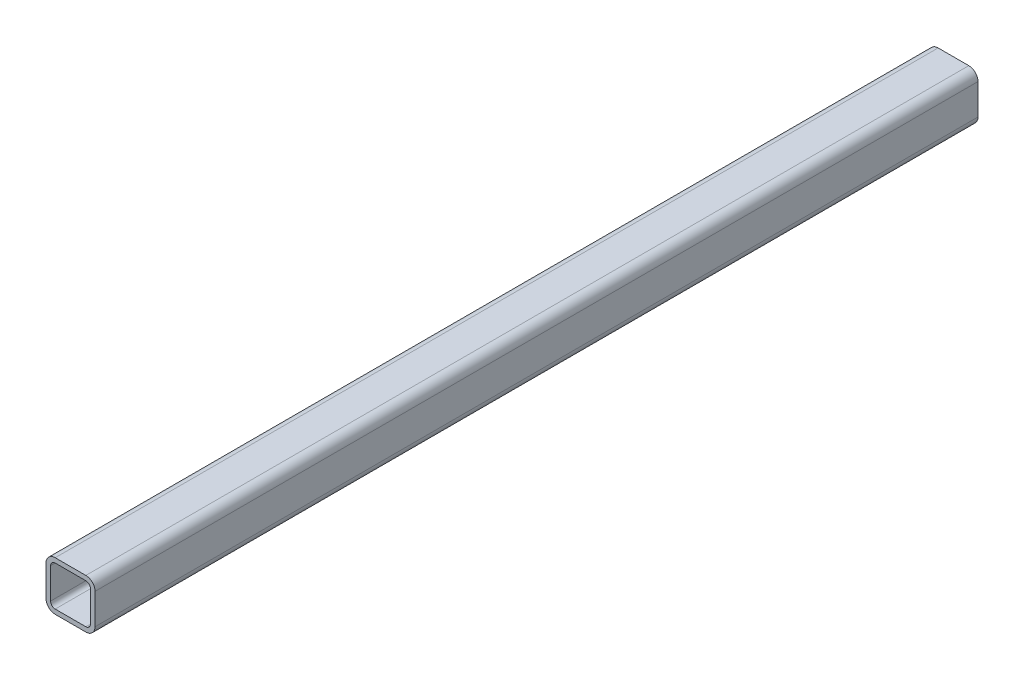
ISO-10303-21;
HEADER;
FILE_DESCRIPTION(('STEP AP214'),'2;1');
FILE_NAME('part.step','',(''),(''),'','','');
FILE_SCHEMA(('AUTOMOTIVE_DESIGN { 1 0 10303 214 1 1 1 1 }'));
ENDSEC;
DATA;
#1=APPLICATION_CONTEXT('core data for automotive mechanical design processes');
#2=APPLICATION_PROTOCOL_DEFINITION('international standard','automotive_design',2000,#1);
#3=PRODUCT_CONTEXT('',#1,'mechanical');
#4=PRODUCT('Part','Part','',(#3));
#5=PRODUCT_RELATED_PRODUCT_CATEGORY('part','',(#4));
#6=PRODUCT_DEFINITION_FORMATION('','',#4);
#7=PRODUCT_DEFINITION_CONTEXT('part definition',#1,'design');
#8=PRODUCT_DEFINITION('design','',#6,#7);
#9=PRODUCT_DEFINITION_SHAPE('','',#8);
#10=(LENGTH_UNIT() NAMED_UNIT(*) SI_UNIT(.MILLI.,.METRE.));
#11=(NAMED_UNIT(*) PLANE_ANGLE_UNIT() SI_UNIT($,.RADIAN.));
#12=(NAMED_UNIT(*) SI_UNIT($,.STERADIAN.) SOLID_ANGLE_UNIT());
#13=UNCERTAINTY_MEASURE_WITH_UNIT(LENGTH_MEASURE(1.E-05),#10,'distance_accuracy_value','');
#14=(GEOMETRIC_REPRESENTATION_CONTEXT(3) GLOBAL_UNCERTAINTY_ASSIGNED_CONTEXT((#13)) GLOBAL_UNIT_ASSIGNED_CONTEXT((#10,
#11,#12)) REPRESENTATION_CONTEXT('',''));
#15=CARTESIAN_POINT('',(0.,0.,0.));
#16=DIRECTION('',(0.,0.,1.));
#17=DIRECTION('',(1.,0.,0.));
#18=AXIS2_PLACEMENT_3D('',#15,#16,#17);
#19=CARTESIAN_POINT('',(41.27496425,41.27496425,457.2));
#20=DIRECTION('',(0.,0.,1.));
#21=DIRECTION('',(1.,0.,0.));
#22=AXIS2_PLACEMENT_3D('',#19,#20,#21);
#23=PLANE('',#22);
#24=CARTESIAN_POINT('',(41.27496425,41.27496425,457.2));
#25=DIRECTION('',(0.,0.,1.));
#26=DIRECTION('',(1.,0.,0.));
#27=AXIS2_PLACEMENT_3D('',#24,#25,#26);
#28=CIRCLE('',#27,9.52499175);
#29=CARTESIAN_POINT('',(50.799956,41.27496425,457.2));
#30=VERTEX_POINT('',#29);
#31=CARTESIAN_POINT('',(41.27496425,50.799956,457.2));
#32=VERTEX_POINT('',#31);
#33=EDGE_CURVE('E213',#30,#32,#28,.T.);
#34=ORIENTED_EDGE('',*,*,#33,.T.);
#35=DIRECTION('',(-1.,0.,0.));
#36=VECTOR('',#35,1.);
#37=CARTESIAN_POINT('',(41.27496425,50.799956,457.2));
#38=LINE('',#37,#36);
#39=CARTESIAN_POINT('',(9.52499174999999,50.799956,457.2));
#40=VERTEX_POINT('',#39);
#41=EDGE_CURVE('E216',#32,#40,#38,.T.);
#42=ORIENTED_EDGE('',*,*,#41,.T.);
#43=CARTESIAN_POINT('',(9.52499174999999,41.27496425,457.2));
#44=DIRECTION('',(0.,0.,1.));
#45=DIRECTION('',(1.,0.,0.));
#46=AXIS2_PLACEMENT_3D('',#43,#44,#45);
#47=CIRCLE('',#46,9.52499175);
#48=CARTESIAN_POINT('',(0.,41.27496425,457.2));
#49=VERTEX_POINT('',#48);
#50=EDGE_CURVE('E219',#40,#49,#47,.T.);
#51=ORIENTED_EDGE('',*,*,#50,.T.);
#52=DIRECTION('',(0.,-1.,0.));
#53=VECTOR('',#52,1.);
#54=CARTESIAN_POINT('',(0.,9.52499175,457.2));
#55=LINE('',#54,#53);
#56=CARTESIAN_POINT('',(0.,9.52499175,457.2));
#57=VERTEX_POINT('',#56);
#58=EDGE_CURVE('E221',#49,#57,#55,.T.);
#59=ORIENTED_EDGE('',*,*,#58,.T.);
#60=CARTESIAN_POINT('',(9.52499175,9.52499175,457.2));
#61=DIRECTION('',(0.,0.,1.));
#62=DIRECTION('',(1.,0.,0.));
#63=AXIS2_PLACEMENT_3D('',#60,#61,#62);
#64=CIRCLE('',#63,9.52499175);
#65=CARTESIAN_POINT('',(9.52499175,0.,457.2));
#66=VERTEX_POINT('',#65);
#67=EDGE_CURVE('E223',#57,#66,#64,.T.);
#68=ORIENTED_EDGE('',*,*,#67,.T.);
#69=DIRECTION('',(1.,0.,0.));
#70=VECTOR('',#69,1.);
#71=CARTESIAN_POINT('',(9.52499175,0.,457.2));
#72=LINE('',#71,#70);
#73=CARTESIAN_POINT('',(41.27496425,0.,457.2));
#74=VERTEX_POINT('',#73);
#75=EDGE_CURVE('E225',#66,#74,#72,.T.);
#76=ORIENTED_EDGE('',*,*,#75,.T.);
#77=CARTESIAN_POINT('',(41.27496425,9.52499175,457.2));
#78=DIRECTION('',(0.,0.,1.));
#79=DIRECTION('',(1.,0.,0.));
#80=AXIS2_PLACEMENT_3D('',#77,#78,#79);
#81=CIRCLE('',#80,9.52499175);
#82=CARTESIAN_POINT('',(50.799956,9.52499175,457.2));
#83=VERTEX_POINT('',#82);
#84=EDGE_CURVE('E227',#74,#83,#81,.T.);
#85=ORIENTED_EDGE('',*,*,#84,.T.);
#86=DIRECTION('',(0.,1.,0.));
#87=VECTOR('',#86,1.);
#88=CARTESIAN_POINT('',(50.799956,41.27496425,457.2));
#89=LINE('',#88,#87);
#90=EDGE_CURVE('E229',#83,#30,#89,.T.);
#91=ORIENTED_EDGE('',*,*,#90,.T.);
#92=EDGE_LOOP('',(#34,#42,#51,#59,#68,#76,#85,#91));
#93=FACE_BOUND('',#92,.T.);
#94=DIRECTION('',(0.,-1.,0.));
#95=VECTOR('',#94,1.);
#96=CARTESIAN_POINT('',(4.762495875,9.52499175,457.2));
#97=LINE('',#96,#95);
#98=CARTESIAN_POINT('',(4.76249587499999,41.27496425,457.2));
#99=VERTEX_POINT('',#98);
#100=CARTESIAN_POINT('',(4.762495875,9.52499175,457.2));
#101=VERTEX_POINT('',#100);
#102=EDGE_CURVE('E156',#99,#101,#97,.T.);
#103=ORIENTED_EDGE('',*,*,#102,.F.);
#104=CARTESIAN_POINT('',(9.52499174999999,41.27496425,457.2));
#105=DIRECTION('',(0.,0.,1.));
#106=DIRECTION('',(1.,0.,0.));
#107=AXIS2_PLACEMENT_3D('',#104,#105,#106);
#108=CIRCLE('',#107,4.762495875);
#109=CARTESIAN_POINT('',(9.52499174999999,46.037460125,457.2));
#110=VERTEX_POINT('',#109);
#111=EDGE_CURVE('E148',#110,#99,#108,.T.);
#112=ORIENTED_EDGE('',*,*,#111,.F.);
#113=DIRECTION('',(-1.,0.,0.));
#114=VECTOR('',#113,1.);
#115=CARTESIAN_POINT('',(41.27496425,46.037460125,457.2));
#116=LINE('',#115,#114);
#117=CARTESIAN_POINT('',(41.27496425,46.037460125,457.2));
#118=VERTEX_POINT('',#117);
#119=EDGE_CURVE('E181',#118,#110,#116,.T.);
#120=ORIENTED_EDGE('',*,*,#119,.F.);
#121=CARTESIAN_POINT('',(41.27496425,41.27496425,457.2));
#122=DIRECTION('',(0.,0.,1.));
#123=DIRECTION('',(1.,0.,0.));
#124=AXIS2_PLACEMENT_3D('',#121,#122,#123);
#125=CIRCLE('',#124,4.76249587500001);
#126=CARTESIAN_POINT('',(46.037460125,41.27496425,457.2));
#127=VERTEX_POINT('',#126);
#128=EDGE_CURVE('E179',#127,#118,#125,.T.);
#129=ORIENTED_EDGE('',*,*,#128,.F.);
#130=DIRECTION('',(0.,1.,0.));
#131=VECTOR('',#130,1.);
#132=CARTESIAN_POINT('',(46.037460125,41.27496425,457.2));
#133=LINE('',#132,#131);
#134=CARTESIAN_POINT('',(46.037460125,9.52499175,457.2));
#135=VERTEX_POINT('',#134);
#136=EDGE_CURVE('E177',#135,#127,#133,.T.);
#137=ORIENTED_EDGE('',*,*,#136,.F.);
#138=CARTESIAN_POINT('',(41.27496425,9.52499175,457.2));
#139=DIRECTION('',(0.,0.,1.));
#140=DIRECTION('',(1.,0.,0.));
#141=AXIS2_PLACEMENT_3D('',#138,#139,#140);
#142=CIRCLE('',#141,4.762495875);
#143=CARTESIAN_POINT('',(41.27496425,4.762495875,457.2));
#144=VERTEX_POINT('',#143);
#145=EDGE_CURVE('E175',#144,#135,#142,.T.);
#146=ORIENTED_EDGE('',*,*,#145,.F.);
#147=DIRECTION('',(1.,0.,0.));
#148=VECTOR('',#147,1.);
#149=CARTESIAN_POINT('',(9.52499175,4.762495875,457.2));
#150=LINE('',#149,#148);
#151=CARTESIAN_POINT('',(9.52499175,4.762495875,457.2));
#152=VERTEX_POINT('',#151);
#153=EDGE_CURVE('E171',#152,#144,#150,.T.);
#154=ORIENTED_EDGE('',*,*,#153,.F.);
#155=CARTESIAN_POINT('',(9.52499175,9.52499175,457.2));
#156=DIRECTION('',(0.,0.,1.));
#157=DIRECTION('',(1.,0.,0.));
#158=AXIS2_PLACEMENT_3D('',#155,#156,#157);
#159=CIRCLE('',#158,4.762495875);
#160=EDGE_CURVE('E169',#101,#152,#159,.T.);
#161=ORIENTED_EDGE('',*,*,#160,.F.);
#162=EDGE_LOOP('',(#103,#112,#120,#129,#137,#146,#154,#161));
#163=FACE_BOUND('',#162,.T.);
#164=ADVANCED_FACE('F35',(#93,#163),#23,.T.);
#165=CARTESIAN_POINT('',(41.27496425,41.27496425,-457.2));
#166=DIRECTION('',(0.,0.,1.));
#167=DIRECTION('',(1.,0.,0.));
#168=AXIS2_PLACEMENT_3D('',#165,#166,#167);
#169=PLANE('',#168);
#170=CARTESIAN_POINT('',(41.27496425,41.27496425,-457.2));
#171=DIRECTION('',(0.,0.,1.));
#172=DIRECTION('',(1.,0.,0.));
#173=AXIS2_PLACEMENT_3D('',#170,#171,#172);
#174=CIRCLE('',#173,9.52499175);
#175=CARTESIAN_POINT('',(50.799956,41.27496425,-457.2));
#176=VERTEX_POINT('',#175);
#177=CARTESIAN_POINT('',(41.27496425,50.799956,-457.2));
#178=VERTEX_POINT('',#177);
#179=EDGE_CURVE('E164',#176,#178,#174,.T.);
#180=ORIENTED_EDGE('',*,*,#179,.F.);
#181=DIRECTION('',(0.,1.,0.));
#182=VECTOR('',#181,1.);
#183=CARTESIAN_POINT('',(50.799956,41.27496425,-457.2));
#184=LINE('',#183,#182);
#185=CARTESIAN_POINT('',(50.799956,9.52499175,-457.2));
#186=VERTEX_POINT('',#185);
#187=EDGE_CURVE('E217',#186,#176,#184,.T.);
#188=ORIENTED_EDGE('',*,*,#187,.F.);
#189=CARTESIAN_POINT('',(41.27496425,9.52499175,-457.2));
#190=DIRECTION('',(0.,0.,1.));
#191=DIRECTION('',(1.,0.,0.));
#192=AXIS2_PLACEMENT_3D('',#189,#190,#191);
#193=CIRCLE('',#192,9.52499175);
#194=CARTESIAN_POINT('',(41.27496425,0.,-457.2));
#195=VERTEX_POINT('',#194);
#196=EDGE_CURVE('E244',#195,#186,#193,.T.);
#197=ORIENTED_EDGE('',*,*,#196,.F.);
#198=DIRECTION('',(1.,0.,0.));
#199=VECTOR('',#198,1.);
#200=CARTESIAN_POINT('',(9.52499175,0.,-457.2));
#201=LINE('',#200,#199);
#202=CARTESIAN_POINT('',(9.52499175,0.,-457.2));
#203=VERTEX_POINT('',#202);
#204=EDGE_CURVE('E242',#203,#195,#201,.T.);
#205=ORIENTED_EDGE('',*,*,#204,.F.);
#206=CARTESIAN_POINT('',(9.52499175,9.52499175,-457.2));
#207=DIRECTION('',(0.,0.,1.));
#208=DIRECTION('',(1.,0.,0.));
#209=AXIS2_PLACEMENT_3D('',#206,#207,#208);
#210=CIRCLE('',#209,9.52499175);
#211=CARTESIAN_POINT('',(0.,9.52499175,-457.2));
#212=VERTEX_POINT('',#211);
#213=EDGE_CURVE('E240',#212,#203,#210,.T.);
#214=ORIENTED_EDGE('',*,*,#213,.F.);
#215=DIRECTION('',(0.,-1.,0.));
#216=VECTOR('',#215,1.);
#217=CARTESIAN_POINT('',(0.,9.52499175,-457.2));
#218=LINE('',#217,#216);
#219=CARTESIAN_POINT('',(0.,41.27496425,-457.2));
#220=VERTEX_POINT('',#219);
#221=EDGE_CURVE('E238',#220,#212,#218,.T.);
#222=ORIENTED_EDGE('',*,*,#221,.F.);
#223=CARTESIAN_POINT('',(9.52499174999999,41.27496425,-457.2));
#224=DIRECTION('',(0.,0.,1.));
#225=DIRECTION('',(1.,0.,0.));
#226=AXIS2_PLACEMENT_3D('',#223,#224,#225);
#227=CIRCLE('',#226,9.52499175);
#228=CARTESIAN_POINT('',(9.52499174999999,50.799956,-457.2));
#229=VERTEX_POINT('',#228);
#230=EDGE_CURVE('E236',#229,#220,#227,.T.);
#231=ORIENTED_EDGE('',*,*,#230,.F.);
#232=DIRECTION('',(-1.,0.,0.));
#233=VECTOR('',#232,1.);
#234=CARTESIAN_POINT('',(41.27496425,50.799956,-457.2));
#235=LINE('',#234,#233);
#236=EDGE_CURVE('E234',#178,#229,#235,.T.);
#237=ORIENTED_EDGE('',*,*,#236,.F.);
#238=EDGE_LOOP('',(#180,#188,#197,#205,#214,#222,#231,#237));
#239=FACE_BOUND('',#238,.T.);
#240=CARTESIAN_POINT('',(9.52499174999999,41.27496425,-457.2));
#241=DIRECTION('',(0.,0.,1.));
#242=DIRECTION('',(1.,0.,0.));
#243=AXIS2_PLACEMENT_3D('',#240,#241,#242);
#244=CIRCLE('',#243,4.762495875);
#245=CARTESIAN_POINT('',(9.52499175,46.037460125,-457.2));
#246=VERTEX_POINT('',#245);
#247=CARTESIAN_POINT('',(4.76249587499999,41.27496425,-457.2));
#248=VERTEX_POINT('',#247);
#249=EDGE_CURVE('E58',#246,#248,#244,.T.);
#250=ORIENTED_EDGE('',*,*,#249,.T.);
#251=DIRECTION('',(0.,-1.,0.));
#252=VECTOR('',#251,1.);
#253=CARTESIAN_POINT('',(4.762495875,9.52499175,-457.2));
#254=LINE('',#253,#252);
#255=CARTESIAN_POINT('',(4.762495875,9.52499175,-457.2));
#256=VERTEX_POINT('',#255);
#257=EDGE_CURVE('E163',#248,#256,#254,.T.);
#258=ORIENTED_EDGE('',*,*,#257,.T.);
#259=CARTESIAN_POINT('',(9.52499175,9.52499175,-457.2));
#260=DIRECTION('',(0.,0.,1.));
#261=DIRECTION('',(1.,0.,0.));
#262=AXIS2_PLACEMENT_3D('',#259,#260,#261);
#263=CIRCLE('',#262,4.762495875);
#264=CARTESIAN_POINT('',(9.52499175,4.762495875,-457.2));
#265=VERTEX_POINT('',#264);
#266=EDGE_CURVE('E185',#256,#265,#263,.T.);
#267=ORIENTED_EDGE('',*,*,#266,.T.);
#268=DIRECTION('',(1.,0.,0.));
#269=VECTOR('',#268,1.);
#270=CARTESIAN_POINT('',(9.52499175,4.762495875,-457.2));
#271=LINE('',#270,#269);
#272=CARTESIAN_POINT('',(41.27496425,4.762495875,-457.2));
#273=VERTEX_POINT('',#272);
#274=EDGE_CURVE('E188',#265,#273,#271,.T.);
#275=ORIENTED_EDGE('',*,*,#274,.T.);
#276=CARTESIAN_POINT('',(41.27496425,9.52499175,-457.2));
#277=DIRECTION('',(0.,0.,1.));
#278=DIRECTION('',(1.,0.,0.));
#279=AXIS2_PLACEMENT_3D('',#276,#277,#278);
#280=CIRCLE('',#279,4.762495875);
#281=CARTESIAN_POINT('',(46.037460125,9.52499175,-457.2));
#282=VERTEX_POINT('',#281);
#283=EDGE_CURVE('E191',#273,#282,#280,.T.);
#284=ORIENTED_EDGE('',*,*,#283,.T.);
#285=DIRECTION('',(0.,1.,0.));
#286=VECTOR('',#285,1.);
#287=CARTESIAN_POINT('',(46.037460125,41.27496425,-457.2));
#288=LINE('',#287,#286);
#289=CARTESIAN_POINT('',(46.037460125,41.27496425,-457.2));
#290=VERTEX_POINT('',#289);
#291=EDGE_CURVE('E194',#282,#290,#288,.T.);
#292=ORIENTED_EDGE('',*,*,#291,.T.);
#293=CARTESIAN_POINT('',(41.27496425,41.27496425,-457.2));
#294=DIRECTION('',(0.,0.,1.));
#295=DIRECTION('',(1.,0.,0.));
#296=AXIS2_PLACEMENT_3D('',#293,#294,#295);
#297=CIRCLE('',#296,4.76249587500001);
#298=CARTESIAN_POINT('',(41.27496425,46.037460125,-457.2));
#299=VERTEX_POINT('',#298);
#300=EDGE_CURVE('E197',#290,#299,#297,.T.);
#301=ORIENTED_EDGE('',*,*,#300,.T.);
#302=DIRECTION('',(-1.,0.,0.));
#303=VECTOR('',#302,1.);
#304=CARTESIAN_POINT('',(41.27496425,46.037460125,-457.2));
#305=LINE('',#304,#303);
#306=EDGE_CURVE('E157',#299,#246,#305,.T.);
#307=ORIENTED_EDGE('',*,*,#306,.T.);
#308=EDGE_LOOP('',(#250,#258,#267,#275,#284,#292,#301,#307));
#309=FACE_BOUND('',#308,.T.);
#310=ADVANCED_FACE('F274',(#239,#309),#169,.F.);
#311=CARTESIAN_POINT('',(41.27496425,41.27496425,457.2));
#312=DIRECTION('',(0.,0.,-1.));
#313=DIRECTION('',(-1.,0.,0.));
#314=AXIS2_PLACEMENT_3D('',#311,#312,#313);
#315=CYLINDRICAL_SURFACE('',#314,9.52499175);
#316=ORIENTED_EDGE('',*,*,#179,.T.);
#317=DIRECTION('',(0.,0.,-1.));
#318=VECTOR('',#317,1.);
#319=CARTESIAN_POINT('',(41.27496425,50.799956,457.2));
#320=LINE('',#319,#318);
#321=EDGE_CURVE('E11',#32,#178,#320,.T.);
#322=ORIENTED_EDGE('',*,*,#321,.F.);
#323=ORIENTED_EDGE('',*,*,#33,.F.);
#324=DIRECTION('',(0.,0.,-1.));
#325=VECTOR('',#324,1.);
#326=CARTESIAN_POINT('',(50.799956,41.27496425,457.2));
#327=LINE('',#326,#325);
#328=EDGE_CURVE('E231',#30,#176,#327,.T.);
#329=ORIENTED_EDGE('',*,*,#328,.T.);
#330=EDGE_LOOP('',(#316,#322,#323,#329));
#331=FACE_BOUND('',#330,.T.);
#332=ADVANCED_FACE('F37',(#331),#315,.T.);
#333=CARTESIAN_POINT('',(41.27496425,50.799956,457.2));
#334=DIRECTION('',(0.,-1.,0.));
#335=DIRECTION('',(0.,0.,-1.));
#336=AXIS2_PLACEMENT_3D('',#333,#334,#335);
#337=PLANE('',#336);
#338=ORIENTED_EDGE('',*,*,#236,.T.);
#339=DIRECTION('',(0.,0.,-1.));
#340=VECTOR('',#339,1.);
#341=CARTESIAN_POINT('',(9.52499174999999,50.799956,457.2));
#342=LINE('',#341,#340);
#343=EDGE_CURVE('E43',#40,#229,#342,.T.);
#344=ORIENTED_EDGE('',*,*,#343,.F.);
#345=ORIENTED_EDGE('',*,*,#41,.F.);
#346=ORIENTED_EDGE('',*,*,#321,.T.);
#347=EDGE_LOOP('',(#338,#344,#345,#346));
#348=FACE_BOUND('',#347,.T.);
#349=ADVANCED_FACE('F291',(#348),#337,.F.);
#350=CARTESIAN_POINT('',(9.52499174999999,41.27496425,457.2));
#351=DIRECTION('',(0.,0.,-1.));
#352=DIRECTION('',(-1.,0.,0.));
#353=AXIS2_PLACEMENT_3D('',#350,#351,#352);
#354=CYLINDRICAL_SURFACE('',#353,9.52499175);
#355=ORIENTED_EDGE('',*,*,#230,.T.);
#356=DIRECTION('',(0.,0.,-1.));
#357=VECTOR('',#356,1.);
#358=CARTESIAN_POINT('',(0.,41.27496425,457.2));
#359=LINE('',#358,#357);
#360=EDGE_CURVE('E261',#49,#220,#359,.T.);
#361=ORIENTED_EDGE('',*,*,#360,.F.);
#362=ORIENTED_EDGE('',*,*,#50,.F.);
#363=ORIENTED_EDGE('',*,*,#343,.T.);
#364=EDGE_LOOP('',(#355,#361,#362,#363));
#365=FACE_BOUND('',#364,.T.);
#366=ADVANCED_FACE('F268',(#365),#354,.T.);
#367=CARTESIAN_POINT('',(0.,9.52499175,457.2));
#368=DIRECTION('',(1.,0.,0.));
#369=DIRECTION('',(0.,1.,0.));
#370=AXIS2_PLACEMENT_3D('',#367,#368,#369);
#371=PLANE('',#370);
#372=ORIENTED_EDGE('',*,*,#221,.T.);
#373=DIRECTION('',(0.,0.,-1.));
#374=VECTOR('',#373,1.);
#375=CARTESIAN_POINT('',(0.,9.52499175,457.2));
#376=LINE('',#375,#374);
#377=EDGE_CURVE('E258',#57,#212,#376,.T.);
#378=ORIENTED_EDGE('',*,*,#377,.F.);
#379=ORIENTED_EDGE('',*,*,#58,.F.);
#380=ORIENTED_EDGE('',*,*,#360,.T.);
#381=EDGE_LOOP('',(#372,#378,#379,#380));
#382=FACE_BOUND('',#381,.T.);
#383=ADVANCED_FACE('F280',(#382),#371,.F.);
#384=CARTESIAN_POINT('',(9.52499175,9.52499175,457.2));
#385=DIRECTION('',(0.,0.,-1.));
#386=DIRECTION('',(-1.,0.,0.));
#387=AXIS2_PLACEMENT_3D('',#384,#385,#386);
#388=CYLINDRICAL_SURFACE('',#387,9.52499175);
#389=ORIENTED_EDGE('',*,*,#213,.T.);
#390=DIRECTION('',(0.,0.,-1.));
#391=VECTOR('',#390,1.);
#392=CARTESIAN_POINT('',(9.52499175,0.,457.2));
#393=LINE('',#392,#391);
#394=EDGE_CURVE('E255',#66,#203,#393,.T.);
#395=ORIENTED_EDGE('',*,*,#394,.F.);
#396=ORIENTED_EDGE('',*,*,#67,.F.);
#397=ORIENTED_EDGE('',*,*,#377,.T.);
#398=EDGE_LOOP('',(#389,#395,#396,#397));
#399=FACE_BOUND('',#398,.T.);
#400=ADVANCED_FACE('F284',(#399),#388,.T.);
#401=CARTESIAN_POINT('',(9.52499175,0.,457.2));
#402=DIRECTION('',(0.,1.,0.));
#403=DIRECTION('',(0.,0.,1.));
#404=AXIS2_PLACEMENT_3D('',#401,#402,#403);
#405=PLANE('',#404);
#406=ORIENTED_EDGE('',*,*,#204,.T.);
#407=DIRECTION('',(0.,0.,-1.));
#408=VECTOR('',#407,1.);
#409=CARTESIAN_POINT('',(41.27496425,0.,457.2));
#410=LINE('',#409,#408);
#411=EDGE_CURVE('E252',#74,#195,#410,.T.);
#412=ORIENTED_EDGE('',*,*,#411,.F.);
#413=ORIENTED_EDGE('',*,*,#75,.F.);
#414=ORIENTED_EDGE('',*,*,#394,.T.);
#415=EDGE_LOOP('',(#406,#412,#413,#414));
#416=FACE_BOUND('',#415,.T.);
#417=ADVANCED_FACE('F304',(#416),#405,.F.);
#418=CARTESIAN_POINT('',(41.27496425,9.52499175,457.2));
#419=DIRECTION('',(0.,0.,-1.));
#420=DIRECTION('',(-1.,0.,0.));
#421=AXIS2_PLACEMENT_3D('',#418,#419,#420);
#422=CYLINDRICAL_SURFACE('',#421,9.52499175);
#423=ORIENTED_EDGE('',*,*,#196,.T.);
#424=DIRECTION('',(0.,0.,-1.));
#425=VECTOR('',#424,1.);
#426=CARTESIAN_POINT('',(50.799956,9.52499175,457.2));
#427=LINE('',#426,#425);
#428=EDGE_CURVE('E249',#83,#186,#427,.T.);
#429=ORIENTED_EDGE('',*,*,#428,.F.);
#430=ORIENTED_EDGE('',*,*,#84,.F.);
#431=ORIENTED_EDGE('',*,*,#411,.T.);
#432=EDGE_LOOP('',(#423,#429,#430,#431));
#433=FACE_BOUND('',#432,.T.);
#434=ADVANCED_FACE('F302',(#433),#422,.T.);
#435=CARTESIAN_POINT('',(50.799956,41.27496425,457.2));
#436=DIRECTION('',(-1.,0.,0.));
#437=DIRECTION('',(0.,-1.,0.));
#438=AXIS2_PLACEMENT_3D('',#435,#436,#437);
#439=PLANE('',#438);
#440=ORIENTED_EDGE('',*,*,#187,.T.);
#441=ORIENTED_EDGE('',*,*,#328,.F.);
#442=ORIENTED_EDGE('',*,*,#90,.F.);
#443=ORIENTED_EDGE('',*,*,#428,.T.);
#444=EDGE_LOOP('',(#440,#441,#442,#443));
#445=FACE_BOUND('',#444,.T.);
#446=ADVANCED_FACE('F297',(#445),#439,.F.);
#447=CARTESIAN_POINT('',(9.52499174999999,41.27496425,457.2));
#448=DIRECTION('',(0.,0.,-1.));
#449=DIRECTION('',(-1.,0.,0.));
#450=AXIS2_PLACEMENT_3D('',#447,#448,#449);
#451=CYLINDRICAL_SURFACE('',#450,4.762495875);
#452=ORIENTED_EDGE('',*,*,#249,.F.);
#453=DIRECTION('',(0.,0.,-1.));
#454=VECTOR('',#453,1.);
#455=CARTESIAN_POINT('',(9.52499174999999,46.037460125,457.2));
#456=LINE('',#455,#454);
#457=EDGE_CURVE('E152',#110,#246,#456,.T.);
#458=ORIENTED_EDGE('',*,*,#457,.F.);
#459=ORIENTED_EDGE('',*,*,#111,.T.);
#460=DIRECTION('',(0.,0.,-1.));
#461=VECTOR('',#460,1.);
#462=CARTESIAN_POINT('',(4.76249587499999,41.27496425,457.2));
#463=LINE('',#462,#461);
#464=EDGE_CURVE('E151',#99,#248,#463,.T.);
#465=ORIENTED_EDGE('',*,*,#464,.T.);
#466=EDGE_LOOP('',(#452,#458,#459,#465));
#467=FACE_BOUND('',#466,.T.);
#468=ADVANCED_FACE('F150',(#467),#451,.F.);
#469=CARTESIAN_POINT('',(4.762495875,9.52499175,457.2));
#470=DIRECTION('',(1.,0.,0.));
#471=DIRECTION('',(0.,1.,0.));
#472=AXIS2_PLACEMENT_3D('',#469,#470,#471);
#473=PLANE('',#472);
#474=ORIENTED_EDGE('',*,*,#257,.F.);
#475=ORIENTED_EDGE('',*,*,#464,.F.);
#476=ORIENTED_EDGE('',*,*,#102,.T.);
#477=DIRECTION('',(0.,0.,-1.));
#478=VECTOR('',#477,1.);
#479=CARTESIAN_POINT('',(4.762495875,9.52499175,457.2));
#480=LINE('',#479,#478);
#481=EDGE_CURVE('E165',#101,#256,#480,.T.);
#482=ORIENTED_EDGE('',*,*,#481,.T.);
#483=EDGE_LOOP('',(#474,#475,#476,#482));
#484=FACE_BOUND('',#483,.T.);
#485=ADVANCED_FACE('F160',(#484),#473,.T.);
#486=CARTESIAN_POINT('',(9.52499175,9.52499175,457.2));
#487=DIRECTION('',(0.,0.,-1.));
#488=DIRECTION('',(-1.,0.,0.));
#489=AXIS2_PLACEMENT_3D('',#486,#487,#488);
#490=CYLINDRICAL_SURFACE('',#489,4.762495875);
#491=ORIENTED_EDGE('',*,*,#266,.F.);
#492=ORIENTED_EDGE('',*,*,#481,.F.);
#493=ORIENTED_EDGE('',*,*,#160,.T.);
#494=DIRECTION('',(0.,0.,-1.));
#495=VECTOR('',#494,1.);
#496=CARTESIAN_POINT('',(9.52499175,4.762495875,457.2));
#497=LINE('',#496,#495);
#498=EDGE_CURVE('E210',#152,#265,#497,.T.);
#499=ORIENTED_EDGE('',*,*,#498,.T.);
#500=EDGE_LOOP('',(#491,#492,#493,#499));
#501=FACE_BOUND('',#500,.T.);
#502=ADVANCED_FACE('F329',(#501),#490,.F.);
#503=CARTESIAN_POINT('',(9.52499175,4.762495875,457.2));
#504=DIRECTION('',(0.,1.,0.));
#505=DIRECTION('',(0.,0.,1.));
#506=AXIS2_PLACEMENT_3D('',#503,#504,#505);
#507=PLANE('',#506);
#508=ORIENTED_EDGE('',*,*,#274,.F.);
#509=ORIENTED_EDGE('',*,*,#498,.F.);
#510=ORIENTED_EDGE('',*,*,#153,.T.);
#511=DIRECTION('',(0.,0.,-1.));
#512=VECTOR('',#511,1.);
#513=CARTESIAN_POINT('',(41.27496425,4.762495875,457.2));
#514=LINE('',#513,#512);
#515=EDGE_CURVE('E208',#144,#273,#514,.T.);
#516=ORIENTED_EDGE('',*,*,#515,.T.);
#517=EDGE_LOOP('',(#508,#509,#510,#516));
#518=FACE_BOUND('',#517,.T.);
#519=ADVANCED_FACE('F333',(#518),#507,.T.);
#520=CARTESIAN_POINT('',(41.27496425,9.52499175,457.2));
#521=DIRECTION('',(0.,0.,-1.));
#522=DIRECTION('',(-1.,0.,0.));
#523=AXIS2_PLACEMENT_3D('',#520,#521,#522);
#524=CYLINDRICAL_SURFACE('',#523,4.762495875);
#525=ORIENTED_EDGE('',*,*,#283,.F.);
#526=ORIENTED_EDGE('',*,*,#515,.F.);
#527=ORIENTED_EDGE('',*,*,#145,.T.);
#528=DIRECTION('',(0.,0.,-1.));
#529=VECTOR('',#528,1.);
#530=CARTESIAN_POINT('',(46.037460125,9.52499175,457.2));
#531=LINE('',#530,#529);
#532=EDGE_CURVE('E206',#135,#282,#531,.T.);
#533=ORIENTED_EDGE('',*,*,#532,.T.);
#534=EDGE_LOOP('',(#525,#526,#527,#533));
#535=FACE_BOUND('',#534,.T.);
#536=ADVANCED_FACE('F339',(#535),#524,.F.);
#537=CARTESIAN_POINT('',(46.037460125,41.27496425,457.2));
#538=DIRECTION('',(-1.,0.,0.));
#539=DIRECTION('',(0.,-1.,0.));
#540=AXIS2_PLACEMENT_3D('',#537,#538,#539);
#541=PLANE('',#540);
#542=ORIENTED_EDGE('',*,*,#291,.F.);
#543=ORIENTED_EDGE('',*,*,#532,.F.);
#544=ORIENTED_EDGE('',*,*,#136,.T.);
#545=DIRECTION('',(0.,0.,-1.));
#546=VECTOR('',#545,1.);
#547=CARTESIAN_POINT('',(46.037460125,41.27496425,457.2));
#548=LINE('',#547,#546);
#549=EDGE_CURVE('E204',#127,#290,#548,.T.);
#550=ORIENTED_EDGE('',*,*,#549,.T.);
#551=EDGE_LOOP('',(#542,#543,#544,#550));
#552=FACE_BOUND('',#551,.T.);
#553=ADVANCED_FACE('F343',(#552),#541,.T.);
#554=CARTESIAN_POINT('',(41.27496425,41.27496425,457.2));
#555=DIRECTION('',(0.,0.,-1.));
#556=DIRECTION('',(-1.,0.,0.));
#557=AXIS2_PLACEMENT_3D('',#554,#555,#556);
#558=CYLINDRICAL_SURFACE('',#557,4.76249587500001);
#559=ORIENTED_EDGE('',*,*,#300,.F.);
#560=ORIENTED_EDGE('',*,*,#549,.F.);
#561=ORIENTED_EDGE('',*,*,#128,.T.);
#562=DIRECTION('',(0.,0.,-1.));
#563=VECTOR('',#562,1.);
#564=CARTESIAN_POINT('',(41.27496425,46.037460125,457.2));
#565=LINE('',#564,#563);
#566=EDGE_CURVE('E50',#118,#299,#565,.T.);
#567=ORIENTED_EDGE('',*,*,#566,.T.);
#568=EDGE_LOOP('',(#559,#560,#561,#567));
#569=FACE_BOUND('',#568,.T.);
#570=ADVANCED_FACE('F347',(#569),#558,.F.);
#571=CARTESIAN_POINT('',(41.27496425,46.037460125,457.2));
#572=DIRECTION('',(0.,-1.,0.));
#573=DIRECTION('',(1.,0.,0.));
#574=AXIS2_PLACEMENT_3D('',#571,#572,#573);
#575=PLANE('',#574);
#576=ORIENTED_EDGE('',*,*,#306,.F.);
#577=ORIENTED_EDGE('',*,*,#566,.F.);
#578=ORIENTED_EDGE('',*,*,#119,.T.);
#579=ORIENTED_EDGE('',*,*,#457,.T.);
#580=EDGE_LOOP('',(#576,#577,#578,#579));
#581=FACE_BOUND('',#580,.T.);
#582=ADVANCED_FACE('F351',(#581),#575,.T.);
#583=CLOSED_SHELL('',(#164,#310,#332,#349,#366,#383,#400,#417,#434,#446,#468,#485,#502,#519,
#536,#553,#570,#582));
#584=MANIFOLD_SOLID_BREP('B2',#583);
#585=ADVANCED_BREP_SHAPE_REPRESENTATION('',(#18,#584),#14);
#586=SHAPE_DEFINITION_REPRESENTATION(#9,#585);
ENDSEC;
END-ISO-10303-21;
